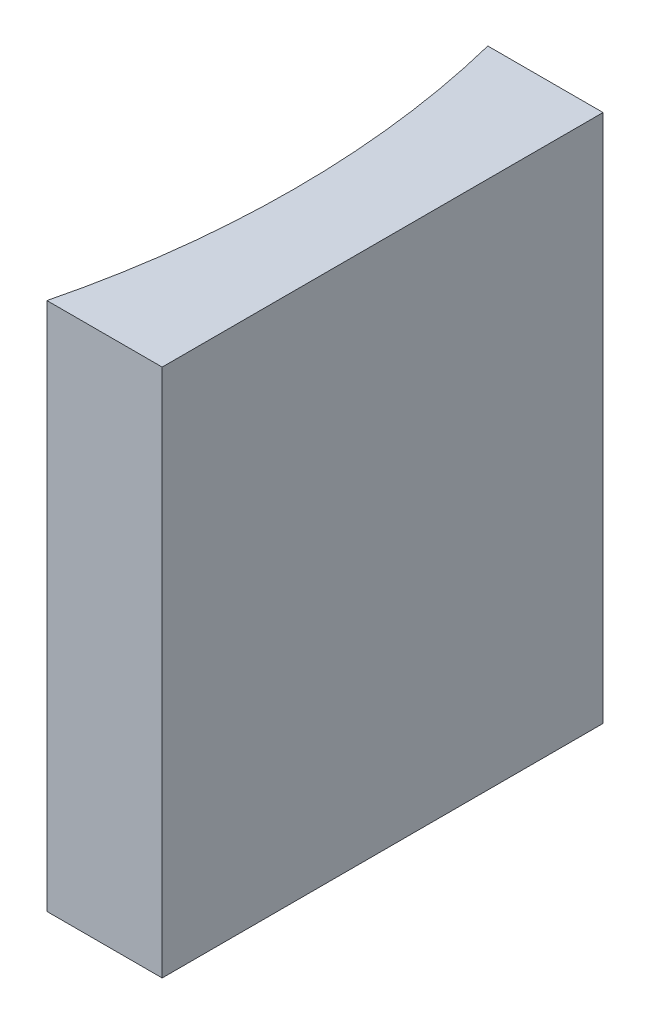
ISO-10303-21;
HEADER;
FILE_DESCRIPTION(('STEP AP214'),'2;1');
FILE_NAME('part.step','',(''),(''),'','','');
FILE_SCHEMA(('AUTOMOTIVE_DESIGN { 1 0 10303 214 1 1 1 1 }'));
ENDSEC;
DATA;
#1=APPLICATION_CONTEXT('core data for automotive mechanical design processes');
#2=APPLICATION_PROTOCOL_DEFINITION('international standard','automotive_design',2000,#1);
#3=PRODUCT_CONTEXT('',#1,'mechanical');
#4=PRODUCT('Part','Part','',(#3));
#5=PRODUCT_RELATED_PRODUCT_CATEGORY('part','',(#4));
#6=PRODUCT_DEFINITION_FORMATION('','',#4);
#7=PRODUCT_DEFINITION_CONTEXT('part definition',#1,'design');
#8=PRODUCT_DEFINITION('design','',#6,#7);
#9=PRODUCT_DEFINITION_SHAPE('','',#8);
#10=(LENGTH_UNIT() NAMED_UNIT(*) SI_UNIT(.MILLI.,.METRE.));
#11=(NAMED_UNIT(*) PLANE_ANGLE_UNIT() SI_UNIT($,.RADIAN.));
#12=(NAMED_UNIT(*) SI_UNIT($,.STERADIAN.) SOLID_ANGLE_UNIT());
#13=UNCERTAINTY_MEASURE_WITH_UNIT(LENGTH_MEASURE(1.E-05),#10,'distance_accuracy_value','');
#14=(GEOMETRIC_REPRESENTATION_CONTEXT(3) GLOBAL_UNCERTAINTY_ASSIGNED_CONTEXT((#13)) GLOBAL_UNIT_ASSIGNED_CONTEXT((#10,
#11,#12)) REPRESENTATION_CONTEXT('',''));
#15=CARTESIAN_POINT('',(0.,0.,0.));
#16=DIRECTION('',(0.,0.,1.));
#17=DIRECTION('',(1.,0.,0.));
#18=AXIS2_PLACEMENT_3D('',#15,#16,#17);
#19=CARTESIAN_POINT('',(0.,12.,0.));
#20=DIRECTION('',(0.,0.,1.));
#21=DIRECTION('',(1.,0.,0.));
#22=AXIS2_PLACEMENT_3D('',#19,#20,#21);
#23=PLANE('',#22);
#24=DIRECTION('',(-1.,0.,0.));
#25=VECTOR('',#24,1.);
#26=CARTESIAN_POINT('',(0.,0.,0.));
#27=LINE('',#26,#25);
#28=CARTESIAN_POINT('',(0.,0.,0.));
#29=VERTEX_POINT('',#28);
#30=CARTESIAN_POINT('',(-2.61355038877081,0.,0.));
#31=VERTEX_POINT('',#30);
#32=EDGE_CURVE('E100',#29,#31,#27,.T.);
#33=ORIENTED_EDGE('',*,*,#32,.T.);
#34=DIRECTION('',(0.,-1.,0.));
#35=VECTOR('',#34,1.);
#36=CARTESIAN_POINT('',(-2.61355038877081,12.,0.));
#37=LINE('',#36,#35);
#38=CARTESIAN_POINT('',(-2.61355038877081,12.,0.));
#39=VERTEX_POINT('',#38);
#40=EDGE_CURVE('E11',#39,#31,#37,.T.);
#41=ORIENTED_EDGE('',*,*,#40,.F.);
#42=DIRECTION('',(-1.,0.,0.));
#43=VECTOR('',#42,1.);
#44=CARTESIAN_POINT('',(0.,12.,0.));
#45=LINE('',#44,#43);
#46=CARTESIAN_POINT('',(0.,12.,0.));
#47=VERTEX_POINT('',#46);
#48=EDGE_CURVE('E88',#47,#39,#45,.T.);
#49=ORIENTED_EDGE('',*,*,#48,.F.);
#50=DIRECTION('',(0.,-1.,0.));
#51=VECTOR('',#50,1.);
#52=CARTESIAN_POINT('',(0.,12.,0.));
#53=LINE('',#52,#51);
#54=EDGE_CURVE('E96',#47,#29,#53,.T.);
#55=ORIENTED_EDGE('',*,*,#54,.T.);
#56=EDGE_LOOP('',(#33,#41,#49,#55));
#57=FACE_BOUND('',#56,.T.);
#58=ADVANCED_FACE('F37',(#57),#23,.F.);
#59=CARTESIAN_POINT('',(-22.68,12.,5.));
#60=DIRECTION('',(0.,-1.,0.));
#61=DIRECTION('',(0.,0.,-1.));
#62=AXIS2_PLACEMENT_3D('',#59,#60,#61);
#63=CYLINDRICAL_SURFACE('',#62,20.68);
#64=CARTESIAN_POINT('',(-22.68,0.,5.));
#65=DIRECTION('',(0.,-1.,0.));
#66=DIRECTION('',(0.,0.,1.));
#67=AXIS2_PLACEMENT_3D('',#64,#65,#66);
#68=CIRCLE('',#67,20.68);
#69=CARTESIAN_POINT('',(-2.61355038877081,0.,10.));
#70=VERTEX_POINT('',#69);
#71=EDGE_CURVE('E92',#31,#70,#68,.T.);
#72=ORIENTED_EDGE('',*,*,#71,.T.);
#73=DIRECTION('',(0.,-1.,0.));
#74=VECTOR('',#73,1.);
#75=CARTESIAN_POINT('',(-2.61355038877081,12.,10.));
#76=LINE('',#75,#74);
#77=CARTESIAN_POINT('',(-2.61355038877081,12.,10.));
#78=VERTEX_POINT('',#77);
#79=EDGE_CURVE('E45',#78,#70,#76,.T.);
#80=ORIENTED_EDGE('',*,*,#79,.F.);
#81=CARTESIAN_POINT('',(-22.68,12.,5.));
#82=DIRECTION('',(0.,-1.,0.));
#83=DIRECTION('',(0.,0.,1.));
#84=AXIS2_PLACEMENT_3D('',#81,#82,#83);
#85=CIRCLE('',#84,20.68);
#86=EDGE_CURVE('E83',#39,#78,#85,.T.);
#87=ORIENTED_EDGE('',*,*,#86,.F.);
#88=ORIENTED_EDGE('',*,*,#40,.T.);
#89=EDGE_LOOP('',(#72,#80,#87,#88));
#90=FACE_BOUND('',#89,.T.);
#91=ADVANCED_FACE('F91',(#90),#63,.F.);
#92=CARTESIAN_POINT('',(0.,12.,10.));
#93=DIRECTION('',(0.,0.,-1.));
#94=DIRECTION('',(-1.,0.,0.));
#95=AXIS2_PLACEMENT_3D('',#92,#93,#94);
#96=PLANE('',#95);
#97=DIRECTION('',(1.,0.,0.));
#98=VECTOR('',#97,1.);
#99=CARTESIAN_POINT('',(0.,0.,10.));
#100=LINE('',#99,#98);
#101=CARTESIAN_POINT('',(0.,0.,10.));
#102=VERTEX_POINT('',#101);
#103=EDGE_CURVE('E70',#70,#102,#100,.T.);
#104=ORIENTED_EDGE('',*,*,#103,.T.);
#105=DIRECTION('',(0.,-1.,0.));
#106=VECTOR('',#105,1.);
#107=CARTESIAN_POINT('',(0.,12.,10.));
#108=LINE('',#107,#106);
#109=CARTESIAN_POINT('',(0.,12.,10.));
#110=VERTEX_POINT('',#109);
#111=EDGE_CURVE('E93',#110,#102,#108,.T.);
#112=ORIENTED_EDGE('',*,*,#111,.F.);
#113=DIRECTION('',(1.,0.,0.));
#114=VECTOR('',#113,1.);
#115=CARTESIAN_POINT('',(0.,12.,10.));
#116=LINE('',#115,#114);
#117=EDGE_CURVE('E86',#78,#110,#116,.T.);
#118=ORIENTED_EDGE('',*,*,#117,.F.);
#119=ORIENTED_EDGE('',*,*,#79,.T.);
#120=EDGE_LOOP('',(#104,#112,#118,#119));
#121=FACE_BOUND('',#120,.T.);
#122=ADVANCED_FACE('F94',(#121),#96,.F.);
#123=CARTESIAN_POINT('',(0.,12.,0.));
#124=DIRECTION('',(-1.,0.,0.));
#125=DIRECTION('',(0.,0.,1.));
#126=AXIS2_PLACEMENT_3D('',#123,#124,#125);
#127=PLANE('',#126);
#128=DIRECTION('',(0.,0.,-1.));
#129=VECTOR('',#128,1.);
#130=CARTESIAN_POINT('',(0.,0.,0.));
#131=LINE('',#130,#129);
#132=EDGE_CURVE('E76',#102,#29,#131,.T.);
#133=ORIENTED_EDGE('',*,*,#132,.T.);
#134=ORIENTED_EDGE('',*,*,#54,.F.);
#135=DIRECTION('',(0.,0.,-1.));
#136=VECTOR('',#135,1.);
#137=CARTESIAN_POINT('',(0.,12.,0.));
#138=LINE('',#137,#136);
#139=EDGE_CURVE('E53',#110,#47,#138,.T.);
#140=ORIENTED_EDGE('',*,*,#139,.F.);
#141=ORIENTED_EDGE('',*,*,#111,.T.);
#142=EDGE_LOOP('',(#133,#134,#140,#141));
#143=FACE_BOUND('',#142,.T.);
#144=ADVANCED_FACE('F107',(#143),#127,.F.);
#145=CARTESIAN_POINT('',(-22.68,12.,5.));
#146=DIRECTION('',(0.,1.,0.));
#147=DIRECTION('',(0.,0.,1.));
#148=AXIS2_PLACEMENT_3D('',#145,#146,#147);
#149=PLANE('',#148);
#150=ORIENTED_EDGE('',*,*,#48,.T.);
#151=ORIENTED_EDGE('',*,*,#86,.T.);
#152=ORIENTED_EDGE('',*,*,#117,.T.);
#153=ORIENTED_EDGE('',*,*,#139,.T.);
#154=EDGE_LOOP('',(#150,#151,#152,#153));
#155=FACE_BOUND('',#154,.T.);
#156=ADVANCED_FACE('F84',(#155),#149,.T.);
#157=CARTESIAN_POINT('',(-22.68,0.,5.));
#158=DIRECTION('',(0.,1.,0.));
#159=DIRECTION('',(0.,0.,1.));
#160=AXIS2_PLACEMENT_3D('',#157,#158,#159);
#161=PLANE('',#160);
#162=ORIENTED_EDGE('',*,*,#32,.F.);
#163=ORIENTED_EDGE('',*,*,#132,.F.);
#164=ORIENTED_EDGE('',*,*,#103,.F.);
#165=ORIENTED_EDGE('',*,*,#71,.F.);
#166=EDGE_LOOP('',(#162,#163,#164,#165));
#167=FACE_BOUND('',#166,.T.);
#168=ADVANCED_FACE('F110',(#167),#161,.F.);
#169=CLOSED_SHELL('',(#58,#91,#122,#144,#156,#168));
#170=MANIFOLD_SOLID_BREP('B2',#169);
#171=ADVANCED_BREP_SHAPE_REPRESENTATION('',(#18,#170),#14);
#172=SHAPE_DEFINITION_REPRESENTATION(#9,#171);
ENDSEC;
END-ISO-10303-21;
